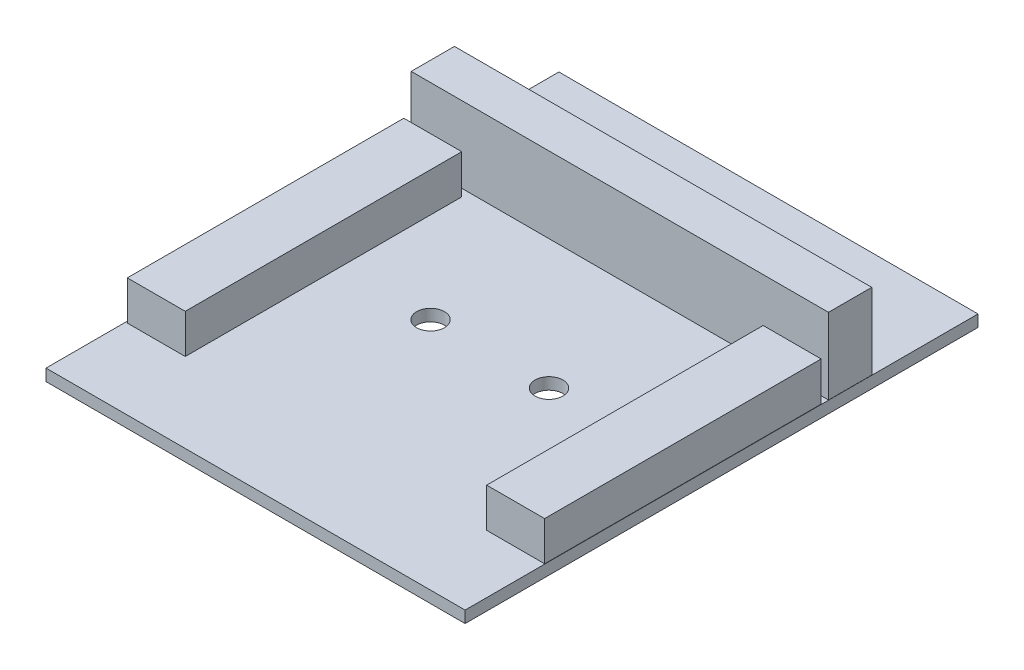
ISO-10303-21;
HEADER;
FILE_DESCRIPTION(('STEP AP214'),'2;1');
FILE_NAME('part.step','',(''),(''),'','','');
FILE_SCHEMA(('AUTOMOTIVE_DESIGN { 1 0 10303 214 1 1 1 1 }'));
ENDSEC;
DATA;
#1=APPLICATION_CONTEXT('core data for automotive mechanical design processes');
#2=APPLICATION_PROTOCOL_DEFINITION('international standard','automotive_design',2000,#1);
#3=PRODUCT_CONTEXT('',#1,'mechanical');
#4=PRODUCT('Part','Part','',(#3));
#5=PRODUCT_RELATED_PRODUCT_CATEGORY('part','',(#4));
#6=PRODUCT_DEFINITION_FORMATION('','',#4);
#7=PRODUCT_DEFINITION_CONTEXT('part definition',#1,'design');
#8=PRODUCT_DEFINITION('design','',#6,#7);
#9=PRODUCT_DEFINITION_SHAPE('','',#8);
#10=(LENGTH_UNIT() NAMED_UNIT(*) SI_UNIT(.MILLI.,.METRE.));
#11=(NAMED_UNIT(*) PLANE_ANGLE_UNIT() SI_UNIT($,.RADIAN.));
#12=(NAMED_UNIT(*) SI_UNIT($,.STERADIAN.) SOLID_ANGLE_UNIT());
#13=UNCERTAINTY_MEASURE_WITH_UNIT(LENGTH_MEASURE(1.E-05),#10,'distance_accuracy_value','');
#14=(GEOMETRIC_REPRESENTATION_CONTEXT(3) GLOBAL_UNCERTAINTY_ASSIGNED_CONTEXT((#13)) GLOBAL_UNIT_ASSIGNED_CONTEXT((#10,
#11,#12)) REPRESENTATION_CONTEXT('',''));
#15=CARTESIAN_POINT('',(0.,0.,0.));
#16=DIRECTION('',(0.,0.,1.));
#17=DIRECTION('',(1.,0.,0.));
#18=AXIS2_PLACEMENT_3D('',#15,#16,#17);
#19=CARTESIAN_POINT('',(0.,1.6,0.));
#20=DIRECTION('',(0.,-1.,0.));
#21=DIRECTION('',(0.,0.,-1.));
#22=AXIS2_PLACEMENT_3D('',#19,#20,#21);
#23=PLANE('',#22);
#24=DIRECTION('',(0.,0.,1.));
#25=VECTOR('',#24,1.);
#26=CARTESIAN_POINT('',(0.228526771816681,1.6,-48.5600222649446));
#27=LINE('',#26,#25);
#28=CARTESIAN_POINT('',(0.228526771816681,1.6,-48.5600222649446));
#29=VERTEX_POINT('',#28);
#30=CARTESIAN_POINT('',(0.228526771816686,1.6,-10.8600222649446));
#31=VERTEX_POINT('',#30);
#32=EDGE_CURVE('E193',#29,#31,#27,.T.);
#33=ORIENTED_EDGE('',*,*,#32,.F.);
#34=DIRECTION('',(-1.,0.,0.));
#35=VECTOR('',#34,1.);
#36=CARTESIAN_POINT('',(0.228526771816681,1.6,-48.5600222649446));
#37=LINE('',#36,#35);
#38=CARTESIAN_POINT('',(8.12852677181667,1.6,-48.5600222649446));
#39=VERTEX_POINT('',#38);
#40=EDGE_CURVE('E186',#39,#29,#37,.T.);
#41=ORIENTED_EDGE('',*,*,#40,.F.);
#42=DIRECTION('',(0.,0.,-1.));
#43=VECTOR('',#42,1.);
#44=CARTESIAN_POINT('',(8.12852677181667,1.6,-48.5600222649446));
#45=LINE('',#44,#43);
#46=CARTESIAN_POINT('',(8.12852677181668,1.6,-10.8600222649446));
#47=VERTEX_POINT('',#46);
#48=EDGE_CURVE('E200',#47,#39,#45,.T.);
#49=ORIENTED_EDGE('',*,*,#48,.F.);
#50=DIRECTION('',(1.,0.,0.));
#51=VECTOR('',#50,1.);
#52=CARTESIAN_POINT('',(0.228526771816686,1.6,-10.8600222649446));
#53=LINE('',#52,#51);
#54=EDGE_CURVE('E196',#31,#47,#53,.T.);
#55=ORIENTED_EDGE('',*,*,#54,.F.);
#56=EDGE_LOOP('',(#33,#41,#49,#55));
#57=FACE_BOUND('',#56,.T.);
#58=CARTESIAN_POINT('',(36.6473814195078,1.6,-31.9356066322648));
#59=DIRECTION('',(0.,1.,0.));
#60=DIRECTION('',(0.,0.,1.));
#61=AXIS2_PLACEMENT_3D('',#58,#59,#60);
#62=CIRCLE('',#61,1.9);
#63=CARTESIAN_POINT('',(36.6473814195078,1.6,-30.0356066322648));
#64=VERTEX_POINT('',#63);
#65=EDGE_CURVE('E245',#64,#64,#62,.T.);
#66=ORIENTED_EDGE('',*,*,#65,.F.);
#67=EDGE_LOOP('',(#66));
#68=FACE_BOUND('',#67,.T.);
#69=CARTESIAN_POINT('',(20.5,1.6,-31.9356066322648));
#70=DIRECTION('',(0.,1.,0.));
#71=DIRECTION('',(0.,0.,1.));
#72=AXIS2_PLACEMENT_3D('',#69,#70,#71);
#73=CIRCLE('',#72,1.9);
#74=CARTESIAN_POINT('',(20.5,1.6,-30.0356066322648));
#75=VERTEX_POINT('',#74);
#76=EDGE_CURVE('E251',#75,#75,#73,.T.);
#77=ORIENTED_EDGE('',*,*,#76,.F.);
#78=EDGE_LOOP('',(#77));
#79=FACE_BOUND('',#78,.T.);
#80=DIRECTION('',(0.,0.,1.));
#81=VECTOR('',#80,1.);
#82=CARTESIAN_POINT('',(0.,1.6,0.));
#83=LINE('',#82,#81);
#84=CARTESIAN_POINT('',(0.,1.6,-69.9356066322648));
#85=VERTEX_POINT('',#84);
#86=CARTESIAN_POINT('',(0.,1.6,0.));
#87=VERTEX_POINT('',#86);
#88=EDGE_CURVE('E257',#85,#87,#83,.T.);
#89=ORIENTED_EDGE('',*,*,#88,.T.);
#90=DIRECTION('',(1.,0.,0.));
#91=VECTOR('',#90,1.);
#92=CARTESIAN_POINT('',(0.,1.6,0.));
#93=LINE('',#92,#91);
#94=CARTESIAN_POINT('',(57.1473814195078,1.6,0.));
#95=VERTEX_POINT('',#94);
#96=EDGE_CURVE('E260',#87,#95,#93,.T.);
#97=ORIENTED_EDGE('',*,*,#96,.T.);
#98=DIRECTION('',(0.,0.,-1.));
#99=VECTOR('',#98,1.);
#100=CARTESIAN_POINT('',(57.1473814195078,1.6,0.));
#101=LINE('',#100,#99);
#102=CARTESIAN_POINT('',(57.1473814195078,1.6,-69.9356066322648));
#103=VERTEX_POINT('',#102);
#104=EDGE_CURVE('E263',#95,#103,#101,.T.);
#105=ORIENTED_EDGE('',*,*,#104,.T.);
#106=DIRECTION('',(-1.,0.,0.));
#107=VECTOR('',#106,1.);
#108=CARTESIAN_POINT('',(0.,1.6,-69.9356066322648));
#109=LINE('',#108,#107);
#110=EDGE_CURVE('E265',#103,#85,#109,.T.);
#111=ORIENTED_EDGE('',*,*,#110,.T.);
#112=EDGE_LOOP('',(#89,#97,#105,#111));
#113=FACE_BOUND('',#112,.T.);
#114=DIRECTION('',(0.,0.,1.));
#115=VECTOR('',#114,1.);
#116=CARTESIAN_POINT('',(49.2058924734056,1.6,-48.5845666638975));
#117=LINE('',#116,#115);
#118=CARTESIAN_POINT('',(49.2058924734056,1.6,-48.5845666638975));
#119=VERTEX_POINT('',#118);
#120=CARTESIAN_POINT('',(49.2058924734056,1.6,-10.8845666638975));
#121=VERTEX_POINT('',#120);
#122=EDGE_CURVE('E197',#119,#121,#117,.T.);
#123=ORIENTED_EDGE('',*,*,#122,.F.);
#124=DIRECTION('',(-1.,0.,0.));
#125=VECTOR('',#124,1.);
#126=CARTESIAN_POINT('',(49.2058924734056,1.6,-48.5845666638975));
#127=LINE('',#126,#125);
#128=CARTESIAN_POINT('',(57.1058924734056,1.6,-48.5845666638975));
#129=VERTEX_POINT('',#128);
#130=EDGE_CURVE('E226',#129,#119,#127,.T.);
#131=ORIENTED_EDGE('',*,*,#130,.F.);
#132=DIRECTION('',(0.,0.,-1.));
#133=VECTOR('',#132,1.);
#134=CARTESIAN_POINT('',(57.1058924734056,1.6,-48.5845666638975));
#135=LINE('',#134,#133);
#136=CARTESIAN_POINT('',(57.1058924734056,1.6,-10.8845666638975));
#137=VERTEX_POINT('',#136);
#138=EDGE_CURVE('E229',#137,#129,#135,.T.);
#139=ORIENTED_EDGE('',*,*,#138,.F.);
#140=DIRECTION('',(1.,0.,0.));
#141=VECTOR('',#140,1.);
#142=CARTESIAN_POINT('',(49.2058924734056,1.6,-10.8845666638975));
#143=LINE('',#142,#141);
#144=EDGE_CURVE('E233',#121,#137,#143,.T.);
#145=ORIENTED_EDGE('',*,*,#144,.F.);
#146=EDGE_LOOP('',(#123,#131,#139,#145));
#147=FACE_BOUND('',#146,.T.);
#148=DIRECTION('',(0.,0.,1.));
#149=VECTOR('',#148,1.);
#150=CARTESIAN_POINT('',(0.220599557709304,1.6,-55.4756066322648));
#151=LINE('',#150,#149);
#152=CARTESIAN_POINT('',(0.220599557709304,1.6,-55.4756066322648));
#153=VERTEX_POINT('',#152);
#154=CARTESIAN_POINT('',(0.220599557709304,1.6,-49.5756066322648));
#155=VERTEX_POINT('',#154);
#156=EDGE_CURVE('E172',#153,#155,#151,.T.);
#157=ORIENTED_EDGE('',*,*,#156,.F.);
#158=DIRECTION('',(-1.,0.,0.));
#159=VECTOR('',#158,1.);
#160=CARTESIAN_POINT('',(0.220599557709304,1.6,-55.4756066322648));
#161=LINE('',#160,#159);
#162=CARTESIAN_POINT('',(57.1205995577093,1.6,-55.4756066322648));
#163=VERTEX_POINT('',#162);
#164=EDGE_CURVE('E169',#163,#153,#161,.T.);
#165=ORIENTED_EDGE('',*,*,#164,.F.);
#166=DIRECTION('',(0.,0.,-1.));
#167=VECTOR('',#166,1.);
#168=CARTESIAN_POINT('',(57.1205995577093,1.6,-55.4756066322648));
#169=LINE('',#168,#167);
#170=CARTESIAN_POINT('',(57.1205995577093,1.6,-49.5756066322648));
#171=VERTEX_POINT('',#170);
#172=EDGE_CURVE('E59',#171,#163,#169,.T.);
#173=ORIENTED_EDGE('',*,*,#172,.F.);
#174=DIRECTION('',(1.,0.,0.));
#175=VECTOR('',#174,1.);
#176=CARTESIAN_POINT('',(0.220599557709304,1.6,-49.5756066322648));
#177=LINE('',#176,#175);
#178=EDGE_CURVE('E54',#155,#171,#177,.T.);
#179=ORIENTED_EDGE('',*,*,#178,.F.);
#180=EDGE_LOOP('',(#157,#165,#173,#179));
#181=FACE_BOUND('',#180,.T.);
#182=ADVANCED_FACE('F39',(#57,#68,#79,#113,#147,#181),#23,.F.);
#183=CARTESIAN_POINT('',(0.,0.,0.));
#184=DIRECTION('',(0.,-1.,0.));
#185=DIRECTION('',(0.,0.,-1.));
#186=AXIS2_PLACEMENT_3D('',#183,#184,#185);
#187=PLANE('',#186);
#188=CARTESIAN_POINT('',(20.5,0.,-31.9356066322648));
#189=DIRECTION('',(0.,1.,0.));
#190=DIRECTION('',(0.,0.,1.));
#191=AXIS2_PLACEMENT_3D('',#188,#189,#190);
#192=CIRCLE('',#191,1.9);
#193=CARTESIAN_POINT('',(20.5,0.,-30.0356066322648));
#194=VERTEX_POINT('',#193);
#195=EDGE_CURVE('E248',#194,#194,#192,.T.);
#196=ORIENTED_EDGE('',*,*,#195,.T.);
#197=EDGE_LOOP('',(#196));
#198=FACE_BOUND('',#197,.T.);
#199=DIRECTION('',(0.,0.,1.));
#200=VECTOR('',#199,1.);
#201=CARTESIAN_POINT('',(0.,0.,0.));
#202=LINE('',#201,#200);
#203=CARTESIAN_POINT('',(0.,0.,-69.9356066322648));
#204=VERTEX_POINT('',#203);
#205=CARTESIAN_POINT('',(0.,0.,0.));
#206=VERTEX_POINT('',#205);
#207=EDGE_CURVE('E254',#204,#206,#202,.T.);
#208=ORIENTED_EDGE('',*,*,#207,.F.);
#209=DIRECTION('',(-1.,0.,0.));
#210=VECTOR('',#209,1.);
#211=CARTESIAN_POINT('',(0.,0.,-69.9356066322648));
#212=LINE('',#211,#210);
#213=CARTESIAN_POINT('',(57.1473814195078,0.,-69.9356066322648));
#214=VERTEX_POINT('',#213);
#215=EDGE_CURVE('E261',#214,#204,#212,.T.);
#216=ORIENTED_EDGE('',*,*,#215,.F.);
#217=DIRECTION('',(0.,0.,-1.));
#218=VECTOR('',#217,1.);
#219=CARTESIAN_POINT('',(57.1473814195078,0.,0.));
#220=LINE('',#219,#218);
#221=CARTESIAN_POINT('',(57.1473814195078,0.,0.));
#222=VERTEX_POINT('',#221);
#223=EDGE_CURVE('E272',#222,#214,#220,.T.);
#224=ORIENTED_EDGE('',*,*,#223,.F.);
#225=DIRECTION('',(1.,0.,0.));
#226=VECTOR('',#225,1.);
#227=CARTESIAN_POINT('',(0.,0.,0.));
#228=LINE('',#227,#226);
#229=EDGE_CURVE('E270',#206,#222,#228,.T.);
#230=ORIENTED_EDGE('',*,*,#229,.F.);
#231=EDGE_LOOP('',(#208,#216,#224,#230));
#232=FACE_BOUND('',#231,.T.);
#233=CARTESIAN_POINT('',(36.6473814195078,0.,-31.9356066322648));
#234=DIRECTION('',(0.,1.,0.));
#235=DIRECTION('',(0.,0.,1.));
#236=AXIS2_PLACEMENT_3D('',#233,#234,#235);
#237=CIRCLE('',#236,1.9);
#238=CARTESIAN_POINT('',(36.6473814195078,0.,-30.0356066322648));
#239=VERTEX_POINT('',#238);
#240=EDGE_CURVE('E215',#239,#239,#237,.T.);
#241=ORIENTED_EDGE('',*,*,#240,.T.);
#242=EDGE_LOOP('',(#241));
#243=FACE_BOUND('',#242,.T.);
#244=ADVANCED_FACE('F290',(#198,#232,#243),#187,.T.);
#245=CARTESIAN_POINT('',(0.,1.6,0.));
#246=DIRECTION('',(1.,0.,0.));
#247=DIRECTION('',(0.,0.,-1.));
#248=AXIS2_PLACEMENT_3D('',#245,#246,#247);
#249=PLANE('',#248);
#250=ORIENTED_EDGE('',*,*,#207,.T.);
#251=DIRECTION('',(0.,-1.,0.));
#252=VECTOR('',#251,1.);
#253=CARTESIAN_POINT('',(0.,1.6,0.));
#254=LINE('',#253,#252);
#255=EDGE_CURVE('E11',#87,#206,#254,.T.);
#256=ORIENTED_EDGE('',*,*,#255,.F.);
#257=ORIENTED_EDGE('',*,*,#88,.F.);
#258=DIRECTION('',(0.,-1.,0.));
#259=VECTOR('',#258,1.);
#260=CARTESIAN_POINT('',(0.,1.6,-69.9356066322648));
#261=LINE('',#260,#259);
#262=EDGE_CURVE('E267',#85,#204,#261,.T.);
#263=ORIENTED_EDGE('',*,*,#262,.T.);
#264=EDGE_LOOP('',(#250,#256,#257,#263));
#265=FACE_BOUND('',#264,.T.);
#266=ADVANCED_FACE('F41',(#265),#249,.F.);
#267=CARTESIAN_POINT('',(0.,1.6,0.));
#268=DIRECTION('',(0.,0.,-1.));
#269=DIRECTION('',(-1.,0.,0.));
#270=AXIS2_PLACEMENT_3D('',#267,#268,#269);
#271=PLANE('',#270);
#272=ORIENTED_EDGE('',*,*,#229,.T.);
#273=DIRECTION('',(0.,-1.,0.));
#274=VECTOR('',#273,1.);
#275=CARTESIAN_POINT('',(57.1473814195078,1.6,0.));
#276=LINE('',#275,#274);
#277=EDGE_CURVE('E47',#95,#222,#276,.T.);
#278=ORIENTED_EDGE('',*,*,#277,.F.);
#279=ORIENTED_EDGE('',*,*,#96,.F.);
#280=ORIENTED_EDGE('',*,*,#255,.T.);
#281=EDGE_LOOP('',(#272,#278,#279,#280));
#282=FACE_BOUND('',#281,.T.);
#283=ADVANCED_FACE('F301',(#282),#271,.F.);
#284=CARTESIAN_POINT('',(57.1473814195078,1.6,0.));
#285=DIRECTION('',(-1.,0.,0.));
#286=DIRECTION('',(0.,0.,1.));
#287=AXIS2_PLACEMENT_3D('',#284,#285,#286);
#288=PLANE('',#287);
#289=ORIENTED_EDGE('',*,*,#223,.T.);
#290=DIRECTION('',(0.,-1.,0.));
#291=VECTOR('',#290,1.);
#292=CARTESIAN_POINT('',(57.1473814195078,1.6,-69.9356066322648));
#293=LINE('',#292,#291);
#294=EDGE_CURVE('E277',#103,#214,#293,.T.);
#295=ORIENTED_EDGE('',*,*,#294,.F.);
#296=ORIENTED_EDGE('',*,*,#104,.F.);
#297=ORIENTED_EDGE('',*,*,#277,.T.);
#298=EDGE_LOOP('',(#289,#295,#296,#297));
#299=FACE_BOUND('',#298,.T.);
#300=ADVANCED_FACE('F284',(#299),#288,.F.);
#301=CARTESIAN_POINT('',(0.,1.6,-69.9356066322648));
#302=DIRECTION('',(0.,0.,1.));
#303=DIRECTION('',(1.,0.,0.));
#304=AXIS2_PLACEMENT_3D('',#301,#302,#303);
#305=PLANE('',#304);
#306=ORIENTED_EDGE('',*,*,#215,.T.);
#307=ORIENTED_EDGE('',*,*,#262,.F.);
#308=ORIENTED_EDGE('',*,*,#110,.F.);
#309=ORIENTED_EDGE('',*,*,#294,.T.);
#310=EDGE_LOOP('',(#306,#307,#308,#309));
#311=FACE_BOUND('',#310,.T.);
#312=ADVANCED_FACE('F294',(#311),#305,.F.);
#313=CARTESIAN_POINT('',(20.5,1.6,-31.9356066322648));
#314=DIRECTION('',(0.,-1.,0.));
#315=DIRECTION('',(0.,0.,-1.));
#316=AXIS2_PLACEMENT_3D('',#313,#314,#315);
#317=CYLINDRICAL_SURFACE('',#316,1.9);
#318=ORIENTED_EDGE('',*,*,#76,.T.);
#319=EDGE_LOOP('',(#318));
#320=FACE_BOUND('',#319,.T.);
#321=ORIENTED_EDGE('',*,*,#195,.F.);
#322=EDGE_LOOP('',(#321));
#323=FACE_BOUND('',#322,.T.);
#324=ADVANCED_FACE('F320',(#320,#323),#317,.F.);
#325=CARTESIAN_POINT('',(36.6473814195078,1.6,-31.9356066322648));
#326=DIRECTION('',(0.,-1.,0.));
#327=DIRECTION('',(0.,0.,-1.));
#328=AXIS2_PLACEMENT_3D('',#325,#326,#327);
#329=CYLINDRICAL_SURFACE('',#328,1.9);
#330=ORIENTED_EDGE('',*,*,#65,.T.);
#331=EDGE_LOOP('',(#330));
#332=FACE_BOUND('',#331,.T.);
#333=ORIENTED_EDGE('',*,*,#240,.F.);
#334=EDGE_LOOP('',(#333));
#335=FACE_BOUND('',#334,.T.);
#336=ADVANCED_FACE('F327',(#332,#335),#329,.F.);
#337=CARTESIAN_POINT('',(49.2058924734056,6.94,-48.5845666638975));
#338=DIRECTION('',(1.,0.,0.));
#339=DIRECTION('',(0.,0.,-1.));
#340=AXIS2_PLACEMENT_3D('',#337,#338,#339);
#341=PLANE('',#340);
#342=ORIENTED_EDGE('',*,*,#122,.T.);
#343=DIRECTION('',(0.,-1.,0.));
#344=VECTOR('',#343,1.);
#345=CARTESIAN_POINT('',(49.2058924734056,6.94,-10.8845666638975));
#346=LINE('',#345,#344);
#347=CARTESIAN_POINT('',(49.2058924734056,6.94,-10.8845666638975));
#348=VERTEX_POINT('',#347);
#349=EDGE_CURVE('E173',#348,#121,#346,.T.);
#350=ORIENTED_EDGE('',*,*,#349,.F.);
#351=DIRECTION('',(0.,0.,1.));
#352=VECTOR('',#351,1.);
#353=CARTESIAN_POINT('',(49.2058924734056,6.94,-48.5845666638975));
#354=LINE('',#353,#352);
#355=CARTESIAN_POINT('',(49.2058924734056,6.94,-48.5845666638975));
#356=VERTEX_POINT('',#355);
#357=EDGE_CURVE('E230',#356,#348,#354,.T.);
#358=ORIENTED_EDGE('',*,*,#357,.F.);
#359=DIRECTION('',(0.,-1.,0.));
#360=VECTOR('',#359,1.);
#361=CARTESIAN_POINT('',(49.2058924734056,6.94,-48.5845666638975));
#362=LINE('',#361,#360);
#363=EDGE_CURVE('E222',#356,#119,#362,.T.);
#364=ORIENTED_EDGE('',*,*,#363,.T.);
#365=EDGE_LOOP('',(#342,#350,#358,#364));
#366=FACE_BOUND('',#365,.T.);
#367=ADVANCED_FACE('F332',(#366),#341,.F.);
#368=CARTESIAN_POINT('',(49.2058924734056,6.94,-10.8845666638975));
#369=DIRECTION('',(0.,0.,-1.));
#370=DIRECTION('',(-1.,0.,0.));
#371=AXIS2_PLACEMENT_3D('',#368,#369,#370);
#372=PLANE('',#371);
#373=ORIENTED_EDGE('',*,*,#144,.T.);
#374=DIRECTION('',(0.,-1.,0.));
#375=VECTOR('',#374,1.);
#376=CARTESIAN_POINT('',(57.1058924734056,6.94,-10.8845666638975));
#377=LINE('',#376,#375);
#378=CARTESIAN_POINT('',(57.1058924734056,6.94,-10.8845666638975));
#379=VERTEX_POINT('',#378);
#380=EDGE_CURVE('E176',#379,#137,#377,.T.);
#381=ORIENTED_EDGE('',*,*,#380,.F.);
#382=DIRECTION('',(1.,0.,0.));
#383=VECTOR('',#382,1.);
#384=CARTESIAN_POINT('',(49.2058924734056,6.94,-10.8845666638975));
#385=LINE('',#384,#383);
#386=EDGE_CURVE('E241',#348,#379,#385,.T.);
#387=ORIENTED_EDGE('',*,*,#386,.F.);
#388=ORIENTED_EDGE('',*,*,#349,.T.);
#389=EDGE_LOOP('',(#373,#381,#387,#388));
#390=FACE_BOUND('',#389,.T.);
#391=ADVANCED_FACE('F341',(#390),#372,.F.);
#392=CARTESIAN_POINT('',(57.1058924734056,6.94,-48.5845666638975));
#393=DIRECTION('',(-1.,0.,0.));
#394=DIRECTION('',(0.,0.,1.));
#395=AXIS2_PLACEMENT_3D('',#392,#393,#394);
#396=PLANE('',#395);
#397=ORIENTED_EDGE('',*,*,#138,.T.);
#398=DIRECTION('',(0.,-1.,0.));
#399=VECTOR('',#398,1.);
#400=CARTESIAN_POINT('',(57.1058924734056,6.94,-48.5845666638975));
#401=LINE('',#400,#399);
#402=CARTESIAN_POINT('',(57.1058924734056,6.94,-48.5845666638975));
#403=VERTEX_POINT('',#402);
#404=EDGE_CURVE('E219',#403,#129,#401,.T.);
#405=ORIENTED_EDGE('',*,*,#404,.F.);
#406=DIRECTION('',(0.,0.,-1.));
#407=VECTOR('',#406,1.);
#408=CARTESIAN_POINT('',(57.1058924734056,6.94,-48.5845666638975));
#409=LINE('',#408,#407);
#410=EDGE_CURVE('E239',#379,#403,#409,.T.);
#411=ORIENTED_EDGE('',*,*,#410,.F.);
#412=ORIENTED_EDGE('',*,*,#380,.T.);
#413=EDGE_LOOP('',(#397,#405,#411,#412));
#414=FACE_BOUND('',#413,.T.);
#415=ADVANCED_FACE('F354',(#414),#396,.F.);
#416=CARTESIAN_POINT('',(49.2058924734056,6.94,-48.5845666638975));
#417=DIRECTION('',(0.,0.,1.));
#418=DIRECTION('',(1.,0.,0.));
#419=AXIS2_PLACEMENT_3D('',#416,#417,#418);
#420=PLANE('',#419);
#421=ORIENTED_EDGE('',*,*,#130,.T.);
#422=ORIENTED_EDGE('',*,*,#363,.F.);
#423=DIRECTION('',(-1.,0.,0.));
#424=VECTOR('',#423,1.);
#425=CARTESIAN_POINT('',(49.2058924734056,6.94,-48.5845666638975));
#426=LINE('',#425,#424);
#427=EDGE_CURVE('E225',#403,#356,#426,.T.);
#428=ORIENTED_EDGE('',*,*,#427,.F.);
#429=ORIENTED_EDGE('',*,*,#404,.T.);
#430=EDGE_LOOP('',(#421,#422,#428,#429));
#431=FACE_BOUND('',#430,.T.);
#432=ADVANCED_FACE('F350',(#431),#420,.F.);
#433=CARTESIAN_POINT('',(0.,6.94,0.));
#434=DIRECTION('',(0.,1.,0.));
#435=DIRECTION('',(0.,0.,1.));
#436=AXIS2_PLACEMENT_3D('',#433,#434,#435);
#437=PLANE('',#436);
#438=ORIENTED_EDGE('',*,*,#357,.T.);
#439=ORIENTED_EDGE('',*,*,#386,.T.);
#440=ORIENTED_EDGE('',*,*,#410,.T.);
#441=ORIENTED_EDGE('',*,*,#427,.T.);
#442=EDGE_LOOP('',(#438,#439,#440,#441));
#443=FACE_BOUND('',#442,.T.);
#444=ADVANCED_FACE('F346',(#443),#437,.T.);
#445=CARTESIAN_POINT('',(0.228526771816681,6.94,-48.5600222649446));
#446=DIRECTION('',(1.,0.,0.));
#447=DIRECTION('',(0.,0.,-1.));
#448=AXIS2_PLACEMENT_3D('',#445,#446,#447);
#449=PLANE('',#448);
#450=ORIENTED_EDGE('',*,*,#32,.T.);
#451=DIRECTION('',(0.,-1.,0.));
#452=VECTOR('',#451,1.);
#453=CARTESIAN_POINT('',(0.228526771816686,6.94,-10.8600222649446));
#454=LINE('',#453,#452);
#455=CARTESIAN_POINT('',(0.228526771816686,6.94,-10.8600222649446));
#456=VERTEX_POINT('',#455);
#457=EDGE_CURVE('E213',#456,#31,#454,.T.);
#458=ORIENTED_EDGE('',*,*,#457,.F.);
#459=DIRECTION('',(0.,0.,1.));
#460=VECTOR('',#459,1.);
#461=CARTESIAN_POINT('',(0.228526771816681,6.94,-48.5600222649446));
#462=LINE('',#461,#460);
#463=CARTESIAN_POINT('',(0.228526771816681,6.94,-48.5600222649446));
#464=VERTEX_POINT('',#463);
#465=EDGE_CURVE('E182',#464,#456,#462,.T.);
#466=ORIENTED_EDGE('',*,*,#465,.F.);
#467=DIRECTION('',(0.,-1.,0.));
#468=VECTOR('',#467,1.);
#469=CARTESIAN_POINT('',(0.228526771816681,6.94,-48.5600222649446));
#470=LINE('',#469,#468);
#471=EDGE_CURVE('E192',#464,#29,#470,.T.);
#472=ORIENTED_EDGE('',*,*,#471,.T.);
#473=EDGE_LOOP('',(#450,#458,#466,#472));
#474=FACE_BOUND('',#473,.T.);
#475=ADVANCED_FACE('F349',(#474),#449,.F.);
#476=CARTESIAN_POINT('',(0.228526771816686,6.94,-10.8600222649446));
#477=DIRECTION('',(0.,0.,-1.));
#478=DIRECTION('',(-1.,0.,0.));
#479=AXIS2_PLACEMENT_3D('',#476,#477,#478);
#480=PLANE('',#479);
#481=ORIENTED_EDGE('',*,*,#54,.T.);
#482=DIRECTION('',(0.,-1.,0.));
#483=VECTOR('',#482,1.);
#484=CARTESIAN_POINT('',(8.12852677181668,6.94,-10.8600222649446));
#485=LINE('',#484,#483);
#486=CARTESIAN_POINT('',(8.12852677181668,6.94,-10.8600222649446));
#487=VERTEX_POINT('',#486);
#488=EDGE_CURVE('E210',#487,#47,#485,.T.);
#489=ORIENTED_EDGE('',*,*,#488,.F.);
#490=DIRECTION('',(1.,0.,0.));
#491=VECTOR('',#490,1.);
#492=CARTESIAN_POINT('',(0.228526771816686,6.94,-10.8600222649446));
#493=LINE('',#492,#491);
#494=EDGE_CURVE('E185',#456,#487,#493,.T.);
#495=ORIENTED_EDGE('',*,*,#494,.F.);
#496=ORIENTED_EDGE('',*,*,#457,.T.);
#497=EDGE_LOOP('',(#481,#489,#495,#496));
#498=FACE_BOUND('',#497,.T.);
#499=ADVANCED_FACE('F364',(#498),#480,.F.);
#500=CARTESIAN_POINT('',(8.12852677181667,6.94,-48.5600222649446));
#501=DIRECTION('',(-1.,0.,0.));
#502=DIRECTION('',(0.,0.,1.));
#503=AXIS2_PLACEMENT_3D('',#500,#501,#502);
#504=PLANE('',#503);
#505=ORIENTED_EDGE('',*,*,#48,.T.);
#506=DIRECTION('',(0.,-1.,0.));
#507=VECTOR('',#506,1.);
#508=CARTESIAN_POINT('',(8.12852677181667,6.94,-48.5600222649446));
#509=LINE('',#508,#507);
#510=CARTESIAN_POINT('',(8.12852677181667,6.94,-48.5600222649446));
#511=VERTEX_POINT('',#510);
#512=EDGE_CURVE('E207',#511,#39,#509,.T.);
#513=ORIENTED_EDGE('',*,*,#512,.F.);
#514=DIRECTION('',(0.,0.,-1.));
#515=VECTOR('',#514,1.);
#516=CARTESIAN_POINT('',(8.12852677181667,6.94,-48.5600222649446));
#517=LINE('',#516,#515);
#518=EDGE_CURVE('E188',#487,#511,#517,.T.);
#519=ORIENTED_EDGE('',*,*,#518,.F.);
#520=ORIENTED_EDGE('',*,*,#488,.T.);
#521=EDGE_LOOP('',(#505,#513,#519,#520));
#522=FACE_BOUND('',#521,.T.);
#523=ADVANCED_FACE('F368',(#522),#504,.F.);
#524=CARTESIAN_POINT('',(0.228526771816681,6.94,-48.5600222649446));
#525=DIRECTION('',(0.,0.,1.));
#526=DIRECTION('',(1.,0.,0.));
#527=AXIS2_PLACEMENT_3D('',#524,#525,#526);
#528=PLANE('',#527);
#529=ORIENTED_EDGE('',*,*,#40,.T.);
#530=ORIENTED_EDGE('',*,*,#471,.F.);
#531=DIRECTION('',(-1.,0.,0.));
#532=VECTOR('',#531,1.);
#533=CARTESIAN_POINT('',(0.228526771816681,6.94,-48.5600222649446));
#534=LINE('',#533,#532);
#535=EDGE_CURVE('E190',#511,#464,#534,.T.);
#536=ORIENTED_EDGE('',*,*,#535,.F.);
#537=ORIENTED_EDGE('',*,*,#512,.T.);
#538=EDGE_LOOP('',(#529,#530,#536,#537));
#539=FACE_BOUND('',#538,.T.);
#540=ADVANCED_FACE('F372',(#539),#528,.F.);
#541=CARTESIAN_POINT('',(0.,6.94,0.));
#542=DIRECTION('',(0.,1.,0.));
#543=DIRECTION('',(0.,0.,1.));
#544=AXIS2_PLACEMENT_3D('',#541,#542,#543);
#545=PLANE('',#544);
#546=ORIENTED_EDGE('',*,*,#465,.T.);
#547=ORIENTED_EDGE('',*,*,#494,.T.);
#548=ORIENTED_EDGE('',*,*,#518,.T.);
#549=ORIENTED_EDGE('',*,*,#535,.T.);
#550=EDGE_LOOP('',(#546,#547,#548,#549));
#551=FACE_BOUND('',#550,.T.);
#552=ADVANCED_FACE('F376',(#551),#545,.T.);
#553=CARTESIAN_POINT('',(0.220599557709304,11.96,-55.4756066322648));
#554=DIRECTION('',(1.,0.,0.));
#555=DIRECTION('',(0.,0.,-1.));
#556=AXIS2_PLACEMENT_3D('',#553,#554,#555);
#557=PLANE('',#556);
#558=ORIENTED_EDGE('',*,*,#156,.T.);
#559=DIRECTION('',(0.,-1.,0.));
#560=VECTOR('',#559,1.);
#561=CARTESIAN_POINT('',(0.220599557709304,11.96,-49.5756066322648));
#562=LINE('',#561,#560);
#563=CARTESIAN_POINT('',(0.220599557709304,11.96,-49.5756066322648));
#564=VERTEX_POINT('',#563);
#565=EDGE_CURVE('E153',#564,#155,#562,.T.);
#566=ORIENTED_EDGE('',*,*,#565,.F.);
#567=DIRECTION('',(0.,0.,1.));
#568=VECTOR('',#567,1.);
#569=CARTESIAN_POINT('',(0.220599557709304,11.96,-55.4756066322648));
#570=LINE('',#569,#568);
#571=CARTESIAN_POINT('',(0.220599557709304,11.96,-55.4756066322648));
#572=VERTEX_POINT('',#571);
#573=EDGE_CURVE('E160',#572,#564,#570,.T.);
#574=ORIENTED_EDGE('',*,*,#573,.F.);
#575=DIRECTION('',(0.,-1.,0.));
#576=VECTOR('',#575,1.);
#577=CARTESIAN_POINT('',(0.220599557709304,11.96,-55.4756066322648));
#578=LINE('',#577,#576);
#579=EDGE_CURVE('E522',#572,#153,#578,.T.);
#580=ORIENTED_EDGE('',*,*,#579,.T.);
#581=EDGE_LOOP('',(#558,#566,#574,#580));
#582=FACE_BOUND('',#581,.T.);
#583=ADVANCED_FACE('F171',(#582),#557,.F.);
#584=CARTESIAN_POINT('',(0.220599557709304,11.96,-49.5756066322648));
#585=DIRECTION('',(0.,0.,-1.));
#586=DIRECTION('',(-1.,0.,0.));
#587=AXIS2_PLACEMENT_3D('',#584,#585,#586);
#588=PLANE('',#587);
#589=ORIENTED_EDGE('',*,*,#178,.T.);
#590=DIRECTION('',(0.,-1.,0.));
#591=VECTOR('',#590,1.);
#592=CARTESIAN_POINT('',(57.1205995577093,11.96,-49.5756066322648));
#593=LINE('',#592,#591);
#594=CARTESIAN_POINT('',(57.1205995577093,11.96,-49.5756066322648));
#595=VERTEX_POINT('',#594);
#596=EDGE_CURVE('E156',#595,#171,#593,.T.);
#597=ORIENTED_EDGE('',*,*,#596,.F.);
#598=DIRECTION('',(1.,0.,0.));
#599=VECTOR('',#598,1.);
#600=CARTESIAN_POINT('',(0.220599557709304,11.96,-49.5756066322648));
#601=LINE('',#600,#599);
#602=EDGE_CURVE('E149',#564,#595,#601,.T.);
#603=ORIENTED_EDGE('',*,*,#602,.F.);
#604=ORIENTED_EDGE('',*,*,#565,.T.);
#605=EDGE_LOOP('',(#589,#597,#603,#604));
#606=FACE_BOUND('',#605,.T.);
#607=ADVANCED_FACE('F151',(#606),#588,.F.);
#608=CARTESIAN_POINT('',(57.1205995577093,11.96,-55.4756066322648));
#609=DIRECTION('',(-1.,0.,0.));
#610=DIRECTION('',(0.,0.,1.));
#611=AXIS2_PLACEMENT_3D('',#608,#609,#610);
#612=PLANE('',#611);
#613=ORIENTED_EDGE('',*,*,#172,.T.);
#614=DIRECTION('',(0.,-1.,0.));
#615=VECTOR('',#614,1.);
#616=CARTESIAN_POINT('',(57.1205995577093,11.96,-55.4756066322648));
#617=LINE('',#616,#615);
#618=CARTESIAN_POINT('',(57.1205995577093,11.96,-55.4756066322648));
#619=VERTEX_POINT('',#618);
#620=EDGE_CURVE('E178',#619,#163,#617,.T.);
#621=ORIENTED_EDGE('',*,*,#620,.F.);
#622=DIRECTION('',(0.,0.,-1.));
#623=VECTOR('',#622,1.);
#624=CARTESIAN_POINT('',(57.1205995577093,11.96,-55.4756066322648));
#625=LINE('',#624,#623);
#626=EDGE_CURVE('E159',#595,#619,#625,.T.);
#627=ORIENTED_EDGE('',*,*,#626,.F.);
#628=ORIENTED_EDGE('',*,*,#596,.T.);
#629=EDGE_LOOP('',(#613,#621,#627,#628));
#630=FACE_BOUND('',#629,.T.);
#631=ADVANCED_FACE('F383',(#630),#612,.F.);
#632=CARTESIAN_POINT('',(0.220599557709304,11.96,-55.4756066322648));
#633=DIRECTION('',(0.,0.,1.));
#634=DIRECTION('',(1.,0.,0.));
#635=AXIS2_PLACEMENT_3D('',#632,#633,#634);
#636=PLANE('',#635);
#637=ORIENTED_EDGE('',*,*,#164,.T.);
#638=ORIENTED_EDGE('',*,*,#579,.F.);
#639=DIRECTION('',(-1.,0.,0.));
#640=VECTOR('',#639,1.);
#641=CARTESIAN_POINT('',(0.220599557709304,11.96,-55.4756066322648));
#642=LINE('',#641,#640);
#643=EDGE_CURVE('E165',#619,#572,#642,.T.);
#644=ORIENTED_EDGE('',*,*,#643,.F.);
#645=ORIENTED_EDGE('',*,*,#620,.T.);
#646=EDGE_LOOP('',(#637,#638,#644,#645));
#647=FACE_BOUND('',#646,.T.);
#648=ADVANCED_FACE('F386',(#647),#636,.F.);
#649=CARTESIAN_POINT('',(0.,11.96,0.));
#650=DIRECTION('',(0.,1.,0.));
#651=DIRECTION('',(0.,0.,1.));
#652=AXIS2_PLACEMENT_3D('',#649,#650,#651);
#653=PLANE('',#652);
#654=ORIENTED_EDGE('',*,*,#573,.T.);
#655=ORIENTED_EDGE('',*,*,#602,.T.);
#656=ORIENTED_EDGE('',*,*,#626,.T.);
#657=ORIENTED_EDGE('',*,*,#643,.T.);
#658=EDGE_LOOP('',(#654,#655,#656,#657));
#659=FACE_BOUND('',#658,.T.);
#660=ADVANCED_FACE('F163',(#659),#653,.T.);
#661=CLOSED_SHELL('',(#182,#244,#266,#283,#300,#312,#324,#336,#367,#391,#415,#432,#444,#475,
#499,#523,#540,#552,#583,#607,#631,#648,#660));
#662=MANIFOLD_SOLID_BREP('B2',#661);
#663=ADVANCED_BREP_SHAPE_REPRESENTATION('',(#18,#662),#14);
#664=SHAPE_DEFINITION_REPRESENTATION(#9,#663);
ENDSEC;
END-ISO-10303-21;
